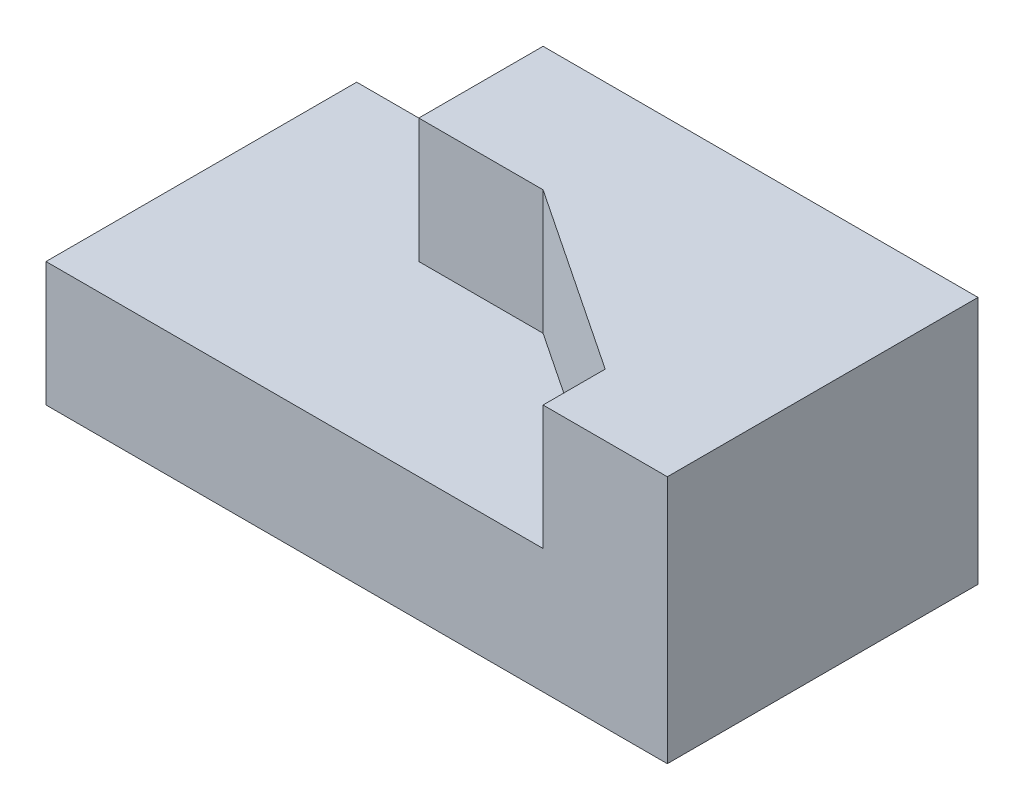
ISO-10303-21;
HEADER;
FILE_DESCRIPTION(('STEP AP214'),'2;1');
FILE_NAME('part.step','',(''),(''),'','','');
FILE_SCHEMA(('AUTOMOTIVE_DESIGN { 1 0 10303 214 1 1 1 1 }'));
ENDSEC;
DATA;
#1=APPLICATION_CONTEXT('core data for automotive mechanical design processes');
#2=APPLICATION_PROTOCOL_DEFINITION('international standard','automotive_design',2000,#1);
#3=PRODUCT_CONTEXT('',#1,'mechanical');
#4=PRODUCT('Part','Part','',(#3));
#5=PRODUCT_RELATED_PRODUCT_CATEGORY('part','',(#4));
#6=PRODUCT_DEFINITION_FORMATION('','',#4);
#7=PRODUCT_DEFINITION_CONTEXT('part definition',#1,'design');
#8=PRODUCT_DEFINITION('design','',#6,#7);
#9=PRODUCT_DEFINITION_SHAPE('','',#8);
#10=(LENGTH_UNIT() NAMED_UNIT(*) SI_UNIT(.MILLI.,.METRE.));
#11=(NAMED_UNIT(*) PLANE_ANGLE_UNIT() SI_UNIT($,.RADIAN.));
#12=(NAMED_UNIT(*) SI_UNIT($,.STERADIAN.) SOLID_ANGLE_UNIT());
#13=UNCERTAINTY_MEASURE_WITH_UNIT(LENGTH_MEASURE(1.E-05),#10,'distance_accuracy_value','');
#14=(GEOMETRIC_REPRESENTATION_CONTEXT(3) GLOBAL_UNCERTAINTY_ASSIGNED_CONTEXT((#13)) GLOBAL_UNIT_ASSIGNED_CONTEXT((#10,
#11,#12)) REPRESENTATION_CONTEXT('',''));
#15=CARTESIAN_POINT('',(0.,0.,0.));
#16=DIRECTION('',(0.,0.,1.));
#17=DIRECTION('',(1.,0.,0.));
#18=AXIS2_PLACEMENT_3D('',#15,#16,#17);
#19=CARTESIAN_POINT('',(0.,20.,0.));
#20=DIRECTION('',(0.,-1.,0.));
#21=DIRECTION('',(0.,0.,-1.));
#22=AXIS2_PLACEMENT_3D('',#19,#20,#21);
#23=PLANE('',#22);
#24=DIRECTION('',(0.,0.,1.));
#25=VECTOR('',#24,1.);
#26=CARTESIAN_POINT('',(80.,20.,-10.));
#27=LINE('',#26,#25);
#28=CARTESIAN_POINT('',(80.,20.,-10.));
#29=VERTEX_POINT('',#28);
#30=CARTESIAN_POINT('',(80.,20.,0.));
#31=VERTEX_POINT('',#30);
#32=EDGE_CURVE('E52',#29,#31,#27,.T.);
#33=ORIENTED_EDGE('',*,*,#32,.F.);
#34=DIRECTION('',(0.832050294337843,0.,0.554700196225229));
#35=VECTOR('',#34,1.);
#36=CARTESIAN_POINT('',(50.,20.,-30.));
#37=LINE('',#36,#35);
#38=CARTESIAN_POINT('',(50.,20.,-30.));
#39=VERTEX_POINT('',#38);
#40=EDGE_CURVE('E56',#39,#29,#37,.T.);
#41=ORIENTED_EDGE('',*,*,#40,.F.);
#42=DIRECTION('',(1.,0.,0.));
#43=VECTOR('',#42,1.);
#44=CARTESIAN_POINT('',(30.,20.,-30.));
#45=LINE('',#44,#43);
#46=CARTESIAN_POINT('',(30.,20.,-30.));
#47=VERTEX_POINT('',#46);
#48=EDGE_CURVE('E169',#47,#39,#45,.T.);
#49=ORIENTED_EDGE('',*,*,#48,.F.);
#50=DIRECTION('',(0.,0.,1.));
#51=VECTOR('',#50,1.);
#52=CARTESIAN_POINT('',(30.,20.,-50.));
#53=LINE('',#52,#51);
#54=CARTESIAN_POINT('',(30.,20.,-50.));
#55=VERTEX_POINT('',#54);
#56=EDGE_CURVE('E168',#55,#47,#53,.T.);
#57=ORIENTED_EDGE('',*,*,#56,.F.);
#58=DIRECTION('',(-1.,0.,0.));
#59=VECTOR('',#58,1.);
#60=CARTESIAN_POINT('',(0.,20.,-50.));
#61=LINE('',#60,#59);
#62=CARTESIAN_POINT('',(0.,20.,-50.));
#63=VERTEX_POINT('',#62);
#64=EDGE_CURVE('E131',#55,#63,#61,.T.);
#65=ORIENTED_EDGE('',*,*,#64,.T.);
#66=DIRECTION('',(0.,0.,1.));
#67=VECTOR('',#66,1.);
#68=CARTESIAN_POINT('',(0.,20.,0.));
#69=LINE('',#68,#67);
#70=CARTESIAN_POINT('',(0.,20.,0.));
#71=VERTEX_POINT('',#70);
#72=EDGE_CURVE('E156',#63,#71,#69,.T.);
#73=ORIENTED_EDGE('',*,*,#72,.T.);
#74=DIRECTION('',(1.,0.,0.));
#75=VECTOR('',#74,1.);
#76=CARTESIAN_POINT('',(0.,20.,0.));
#77=LINE('',#76,#75);
#78=EDGE_CURVE('E159',#71,#31,#77,.T.);
#79=ORIENTED_EDGE('',*,*,#78,.T.);
#80=EDGE_LOOP('',(#33,#41,#49,#57,#65,#73,#79));
#81=FACE_BOUND('',#80,.T.);
#82=ADVANCED_FACE('F35',(#81),#23,.F.);
#83=CARTESIAN_POINT('',(0.,20.,0.));
#84=DIRECTION('',(1.,0.,0.));
#85=DIRECTION('',(0.,0.,-1.));
#86=AXIS2_PLACEMENT_3D('',#83,#84,#85);
#87=PLANE('',#86);
#88=DIRECTION('',(0.,0.,1.));
#89=VECTOR('',#88,1.);
#90=CARTESIAN_POINT('',(0.,0.,0.));
#91=LINE('',#90,#89);
#92=CARTESIAN_POINT('',(0.,0.,-50.));
#93=VERTEX_POINT('',#92);
#94=CARTESIAN_POINT('',(0.,0.,0.));
#95=VERTEX_POINT('',#94);
#96=EDGE_CURVE('E132',#93,#95,#91,.T.);
#97=ORIENTED_EDGE('',*,*,#96,.T.);
#98=DIRECTION('',(0.,-1.,0.));
#99=VECTOR('',#98,1.);
#100=CARTESIAN_POINT('',(0.,20.,0.));
#101=LINE('',#100,#99);
#102=EDGE_CURVE('E11',#71,#95,#101,.T.);
#103=ORIENTED_EDGE('',*,*,#102,.F.);
#104=ORIENTED_EDGE('',*,*,#72,.F.);
#105=DIRECTION('',(0.,-1.,0.));
#106=VECTOR('',#105,1.);
#107=CARTESIAN_POINT('',(0.,20.,-50.));
#108=LINE('',#107,#106);
#109=EDGE_CURVE('E167',#63,#93,#108,.T.);
#110=ORIENTED_EDGE('',*,*,#109,.T.);
#111=EDGE_LOOP('',(#97,#103,#104,#110));
#112=FACE_BOUND('',#111,.T.);
#113=ADVANCED_FACE('F37',(#112),#87,.F.);
#114=CARTESIAN_POINT('',(0.,20.,0.));
#115=DIRECTION('',(0.,0.,-1.));
#116=DIRECTION('',(-1.,0.,0.));
#117=AXIS2_PLACEMENT_3D('',#114,#115,#116);
#118=PLANE('',#117);
#119=DIRECTION('',(1.,0.,0.));
#120=VECTOR('',#119,1.);
#121=CARTESIAN_POINT('',(0.,0.,0.));
#122=LINE('',#121,#120);
#123=CARTESIAN_POINT('',(100.,0.,0.));
#124=VERTEX_POINT('',#123);
#125=EDGE_CURVE('E135',#95,#124,#122,.T.);
#126=ORIENTED_EDGE('',*,*,#125,.T.);
#127=DIRECTION('',(0.,-1.,0.));
#128=VECTOR('',#127,1.);
#129=CARTESIAN_POINT('',(100.,20.,0.));
#130=LINE('',#129,#128);
#131=CARTESIAN_POINT('',(100.,40.,0.));
#132=VERTEX_POINT('',#131);
#133=EDGE_CURVE('E44',#132,#124,#130,.T.);
#134=ORIENTED_EDGE('',*,*,#133,.F.);
#135=DIRECTION('',(1.,0.,0.));
#136=VECTOR('',#135,1.);
#137=CARTESIAN_POINT('',(80.,40.,0.));
#138=LINE('',#137,#136);
#139=CARTESIAN_POINT('',(80.,40.,0.));
#140=VERTEX_POINT('',#139);
#141=EDGE_CURVE('E174',#140,#132,#138,.T.);
#142=ORIENTED_EDGE('',*,*,#141,.F.);
#143=DIRECTION('',(0.,-1.,0.));
#144=VECTOR('',#143,1.);
#145=CARTESIAN_POINT('',(80.,40.,0.));
#146=LINE('',#145,#144);
#147=EDGE_CURVE('E146',#140,#31,#146,.T.);
#148=ORIENTED_EDGE('',*,*,#147,.T.);
#149=ORIENTED_EDGE('',*,*,#78,.F.);
#150=ORIENTED_EDGE('',*,*,#102,.T.);
#151=EDGE_LOOP('',(#126,#134,#142,#148,#149,#150));
#152=FACE_BOUND('',#151,.T.);
#153=ADVANCED_FACE('F205',(#152),#118,.F.);
#154=CARTESIAN_POINT('',(100.,20.,0.));
#155=DIRECTION('',(-1.,0.,0.));
#156=DIRECTION('',(0.,0.,1.));
#157=AXIS2_PLACEMENT_3D('',#154,#155,#156);
#158=PLANE('',#157);
#159=DIRECTION('',(0.,0.,-1.));
#160=VECTOR('',#159,1.);
#161=CARTESIAN_POINT('',(100.,0.,0.));
#162=LINE('',#161,#160);
#163=CARTESIAN_POINT('',(100.,0.,-50.));
#164=VERTEX_POINT('',#163);
#165=EDGE_CURVE('E197',#124,#164,#162,.T.);
#166=ORIENTED_EDGE('',*,*,#165,.T.);
#167=DIRECTION('',(0.,-1.,0.));
#168=VECTOR('',#167,1.);
#169=CARTESIAN_POINT('',(100.,20.,-50.));
#170=LINE('',#169,#168);
#171=CARTESIAN_POINT('',(100.,40.,-50.));
#172=VERTEX_POINT('',#171);
#173=EDGE_CURVE('E196',#172,#164,#170,.T.);
#174=ORIENTED_EDGE('',*,*,#173,.F.);
#175=DIRECTION('',(0.,0.,-1.));
#176=VECTOR('',#175,1.);
#177=CARTESIAN_POINT('',(100.,40.,0.));
#178=LINE('',#177,#176);
#179=EDGE_CURVE('E124',#132,#172,#178,.T.);
#180=ORIENTED_EDGE('',*,*,#179,.F.);
#181=ORIENTED_EDGE('',*,*,#133,.T.);
#182=EDGE_LOOP('',(#166,#174,#180,#181));
#183=FACE_BOUND('',#182,.T.);
#184=ADVANCED_FACE('F194',(#183),#158,.F.);
#185=CARTESIAN_POINT('',(0.,20.,-50.));
#186=DIRECTION('',(0.,0.,1.));
#187=DIRECTION('',(1.,0.,0.));
#188=AXIS2_PLACEMENT_3D('',#185,#186,#187);
#189=PLANE('',#188);
#190=DIRECTION('',(-1.,0.,0.));
#191=VECTOR('',#190,1.);
#192=CARTESIAN_POINT('',(0.,0.,-50.));
#193=LINE('',#192,#191);
#194=EDGE_CURVE('E160',#164,#93,#193,.T.);
#195=ORIENTED_EDGE('',*,*,#194,.T.);
#196=ORIENTED_EDGE('',*,*,#109,.F.);
#197=ORIENTED_EDGE('',*,*,#64,.F.);
#198=DIRECTION('',(0.,-1.,0.));
#199=VECTOR('',#198,1.);
#200=CARTESIAN_POINT('',(30.,40.,-50.));
#201=LINE('',#200,#199);
#202=CARTESIAN_POINT('',(30.,40.,-50.));
#203=VERTEX_POINT('',#202);
#204=EDGE_CURVE('E111',#203,#55,#201,.T.);
#205=ORIENTED_EDGE('',*,*,#204,.F.);
#206=DIRECTION('',(-1.,0.,0.));
#207=VECTOR('',#206,1.);
#208=CARTESIAN_POINT('',(100.,40.,-50.));
#209=LINE('',#208,#207);
#210=EDGE_CURVE('E117',#172,#203,#209,.T.);
#211=ORIENTED_EDGE('',*,*,#210,.F.);
#212=ORIENTED_EDGE('',*,*,#173,.T.);
#213=EDGE_LOOP('',(#195,#196,#197,#205,#211,#212));
#214=FACE_BOUND('',#213,.T.);
#215=ADVANCED_FACE('F129',(#214),#189,.F.);
#216=CARTESIAN_POINT('',(0.,0.,0.));
#217=DIRECTION('',(0.,-1.,0.));
#218=DIRECTION('',(0.,0.,-1.));
#219=AXIS2_PLACEMENT_3D('',#216,#217,#218);
#220=PLANE('',#219);
#221=ORIENTED_EDGE('',*,*,#96,.F.);
#222=ORIENTED_EDGE('',*,*,#194,.F.);
#223=ORIENTED_EDGE('',*,*,#165,.F.);
#224=ORIENTED_EDGE('',*,*,#125,.F.);
#225=EDGE_LOOP('',(#221,#222,#223,#224));
#226=FACE_BOUND('',#225,.T.);
#227=ADVANCED_FACE('F209',(#226),#220,.T.);
#228=CARTESIAN_POINT('',(30.,40.,-50.));
#229=DIRECTION('',(1.,0.,0.));
#230=DIRECTION('',(0.,0.,-1.));
#231=AXIS2_PLACEMENT_3D('',#228,#229,#230);
#232=PLANE('',#231);
#233=ORIENTED_EDGE('',*,*,#56,.T.);
#234=DIRECTION('',(0.,-1.,0.));
#235=VECTOR('',#234,1.);
#236=CARTESIAN_POINT('',(30.,40.,-30.));
#237=LINE('',#236,#235);
#238=CARTESIAN_POINT('',(30.,40.,-30.));
#239=VERTEX_POINT('',#238);
#240=EDGE_CURVE('E113',#239,#47,#237,.T.);
#241=ORIENTED_EDGE('',*,*,#240,.F.);
#242=DIRECTION('',(0.,0.,1.));
#243=VECTOR('',#242,1.);
#244=CARTESIAN_POINT('',(30.,40.,-50.));
#245=LINE('',#244,#243);
#246=EDGE_CURVE('E106',#203,#239,#245,.T.);
#247=ORIENTED_EDGE('',*,*,#246,.F.);
#248=ORIENTED_EDGE('',*,*,#204,.T.);
#249=EDGE_LOOP('',(#233,#241,#247,#248));
#250=FACE_BOUND('',#249,.T.);
#251=ADVANCED_FACE('F109',(#250),#232,.F.);
#252=CARTESIAN_POINT('',(30.,40.,-30.));
#253=DIRECTION('',(0.,0.,-1.));
#254=DIRECTION('',(-1.,0.,0.));
#255=AXIS2_PLACEMENT_3D('',#252,#253,#254);
#256=PLANE('',#255);
#257=ORIENTED_EDGE('',*,*,#48,.T.);
#258=DIRECTION('',(0.,-1.,0.));
#259=VECTOR('',#258,1.);
#260=CARTESIAN_POINT('',(50.,40.,-30.));
#261=LINE('',#260,#259);
#262=CARTESIAN_POINT('',(50.,40.,-30.));
#263=VERTEX_POINT('',#262);
#264=EDGE_CURVE('E137',#263,#39,#261,.T.);
#265=ORIENTED_EDGE('',*,*,#264,.F.);
#266=DIRECTION('',(1.,0.,0.));
#267=VECTOR('',#266,1.);
#268=CARTESIAN_POINT('',(30.,40.,-30.));
#269=LINE('',#268,#267);
#270=EDGE_CURVE('E116',#239,#263,#269,.T.);
#271=ORIENTED_EDGE('',*,*,#270,.F.);
#272=ORIENTED_EDGE('',*,*,#240,.T.);
#273=EDGE_LOOP('',(#257,#265,#271,#272));
#274=FACE_BOUND('',#273,.T.);
#275=ADVANCED_FACE('F182',(#274),#256,.F.);
#276=CARTESIAN_POINT('',(50.,40.,-30.));
#277=DIRECTION('',(0.554700196225229,0.,-0.832050294337844));
#278=DIRECTION('',(-0.832050294337844,0.,-0.554700196225229));
#279=AXIS2_PLACEMENT_3D('',#276,#277,#278);
#280=PLANE('',#279);
#281=ORIENTED_EDGE('',*,*,#40,.T.);
#282=DIRECTION('',(0.,-1.,0.));
#283=VECTOR('',#282,1.);
#284=CARTESIAN_POINT('',(80.,40.,-10.));
#285=LINE('',#284,#283);
#286=CARTESIAN_POINT('',(80.,40.,-10.));
#287=VERTEX_POINT('',#286);
#288=EDGE_CURVE('E151',#287,#29,#285,.T.);
#289=ORIENTED_EDGE('',*,*,#288,.F.);
#290=DIRECTION('',(0.832050294337843,0.,0.554700196225229));
#291=VECTOR('',#290,1.);
#292=CARTESIAN_POINT('',(50.,40.,-30.));
#293=LINE('',#292,#291);
#294=EDGE_CURVE('E178',#263,#287,#293,.T.);
#295=ORIENTED_EDGE('',*,*,#294,.F.);
#296=ORIENTED_EDGE('',*,*,#264,.T.);
#297=EDGE_LOOP('',(#281,#289,#295,#296));
#298=FACE_BOUND('',#297,.T.);
#299=ADVANCED_FACE('F184',(#298),#280,.F.);
#300=CARTESIAN_POINT('',(80.,40.,-10.));
#301=DIRECTION('',(1.,0.,0.));
#302=DIRECTION('',(0.,0.,-1.));
#303=AXIS2_PLACEMENT_3D('',#300,#301,#302);
#304=PLANE('',#303);
#305=ORIENTED_EDGE('',*,*,#32,.T.);
#306=ORIENTED_EDGE('',*,*,#147,.F.);
#307=DIRECTION('',(0.,0.,1.));
#308=VECTOR('',#307,1.);
#309=CARTESIAN_POINT('',(80.,40.,-10.));
#310=LINE('',#309,#308);
#311=EDGE_CURVE('E176',#287,#140,#310,.T.);
#312=ORIENTED_EDGE('',*,*,#311,.F.);
#313=ORIENTED_EDGE('',*,*,#288,.T.);
#314=EDGE_LOOP('',(#305,#306,#312,#313));
#315=FACE_BOUND('',#314,.T.);
#316=ADVANCED_FACE('F188',(#315),#304,.F.);
#317=CARTESIAN_POINT('',(0.,40.,0.));
#318=DIRECTION('',(0.,1.,0.));
#319=DIRECTION('',(0.,0.,1.));
#320=AXIS2_PLACEMENT_3D('',#317,#318,#319);
#321=PLANE('',#320);
#322=ORIENTED_EDGE('',*,*,#210,.T.);
#323=ORIENTED_EDGE('',*,*,#246,.T.);
#324=ORIENTED_EDGE('',*,*,#270,.T.);
#325=ORIENTED_EDGE('',*,*,#294,.T.);
#326=ORIENTED_EDGE('',*,*,#311,.T.);
#327=ORIENTED_EDGE('',*,*,#141,.T.);
#328=ORIENTED_EDGE('',*,*,#179,.T.);
#329=EDGE_LOOP('',(#322,#323,#324,#325,#326,#327,#328));
#330=FACE_BOUND('',#329,.T.);
#331=ADVANCED_FACE('F121',(#330),#321,.T.);
#332=CLOSED_SHELL('',(#82,#113,#153,#184,#215,#227,#251,#275,#299,#316,#331));
#333=MANIFOLD_SOLID_BREP('B2',#332);
#334=ADVANCED_BREP_SHAPE_REPRESENTATION('',(#18,#333),#14);
#335=SHAPE_DEFINITION_REPRESENTATION(#9,#334);
ENDSEC;
END-ISO-10303-21;
